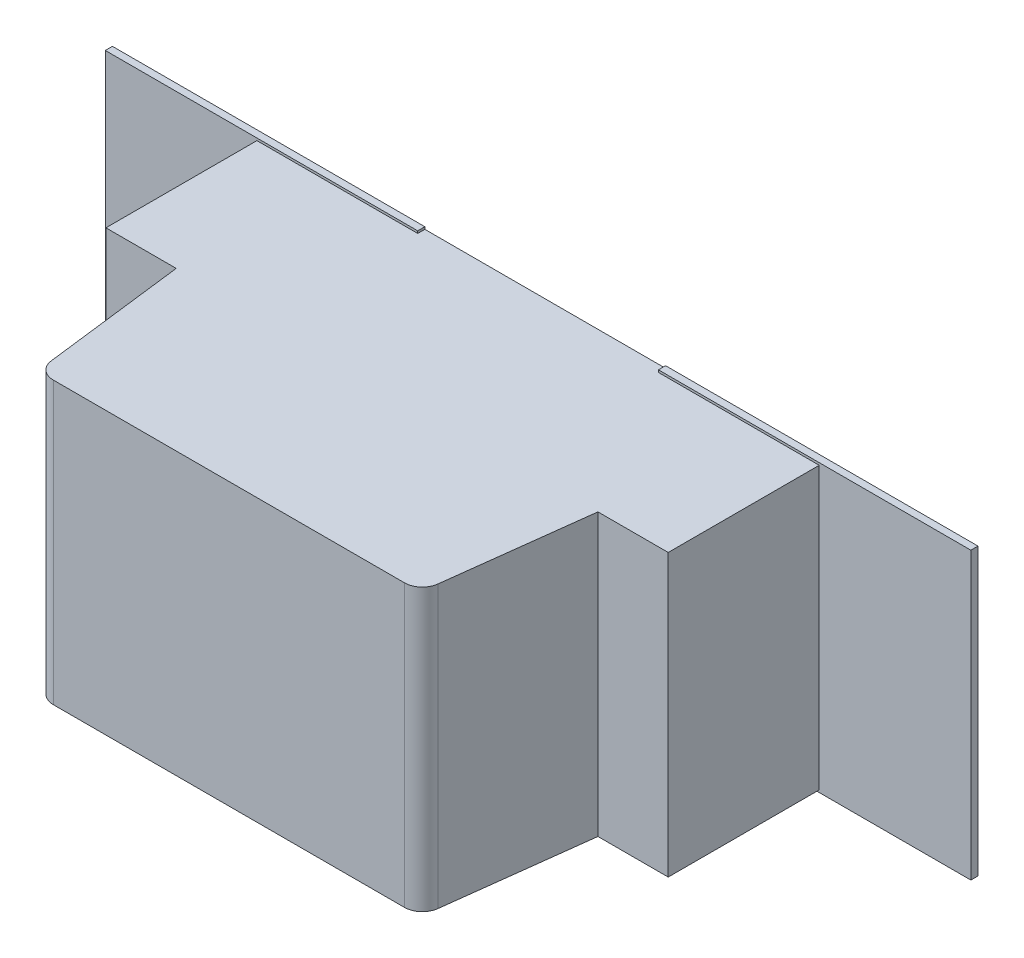
ISO-10303-21;
HEADER;
FILE_DESCRIPTION(('STEP AP214'),'2;1');
FILE_NAME('part.step','',(''),(''),'','','');
FILE_SCHEMA(('AUTOMOTIVE_DESIGN { 1 0 10303 214 1 1 1 1 }'));
ENDSEC;
DATA;
#1=APPLICATION_CONTEXT('core data for automotive mechanical design processes');
#2=APPLICATION_PROTOCOL_DEFINITION('international standard','automotive_design',2000,#1);
#3=PRODUCT_CONTEXT('',#1,'mechanical');
#4=PRODUCT('Part','Part','',(#3));
#5=PRODUCT_RELATED_PRODUCT_CATEGORY('part','',(#4));
#6=PRODUCT_DEFINITION_FORMATION('','',#4);
#7=PRODUCT_DEFINITION_CONTEXT('part definition',#1,'design');
#8=PRODUCT_DEFINITION('design','',#6,#7);
#9=PRODUCT_DEFINITION_SHAPE('','',#8);
#10=(LENGTH_UNIT() NAMED_UNIT(*) SI_UNIT(.MILLI.,.METRE.));
#11=(NAMED_UNIT(*) PLANE_ANGLE_UNIT() SI_UNIT($,.RADIAN.));
#12=(NAMED_UNIT(*) SI_UNIT($,.STERADIAN.) SOLID_ANGLE_UNIT());
#13=UNCERTAINTY_MEASURE_WITH_UNIT(LENGTH_MEASURE(1.E-05),#10,'distance_accuracy_value','');
#14=(GEOMETRIC_REPRESENTATION_CONTEXT(3) GLOBAL_UNCERTAINTY_ASSIGNED_CONTEXT((#13)) GLOBAL_UNIT_ASSIGNED_CONTEXT((#10,
#11,#12)) REPRESENTATION_CONTEXT('',''));
#15=CARTESIAN_POINT('',(0.,0.,0.));
#16=DIRECTION('',(0.,0.,1.));
#17=DIRECTION('',(1.,0.,0.));
#18=AXIS2_PLACEMENT_3D('',#15,#16,#17);
#19=CARTESIAN_POINT('',(0.,0.,0.09652));
#20=DIRECTION('',(0.,0.,1.));
#21=DIRECTION('',(1.,0.,0.));
#22=AXIS2_PLACEMENT_3D('',#19,#20,#21);
#23=PLANE('',#22);
#24=DIRECTION('',(0.,1.,0.));
#25=VECTOR('',#24,1.);
#26=CARTESIAN_POINT('',(-0.3424936,-0.4065016,0.09652));
#27=LINE('',#26,#25);
#28=CARTESIAN_POINT('',(-0.3424936,-0.4,0.09652));
#29=VERTEX_POINT('',#28);
#30=CARTESIAN_POINT('',(-0.3424936,-0.4065016,0.09652));
#31=VERTEX_POINT('',#30);
#32=EDGE_CURVE('E307',#29,#31,#27,.F.);
#33=ORIENTED_EDGE('',*,*,#32,.F.);
#34=DIRECTION('',(1.,0.,0.));
#35=VECTOR('',#34,1.);
#36=CARTESIAN_POINT('',(0.,-0.4,0.09652));
#37=LINE('',#36,#35);
#38=CARTESIAN_POINT('',(-0.8,-0.4,0.09652));
#39=VERTEX_POINT('',#38);
#40=EDGE_CURVE('E160',#29,#39,#37,.F.);
#41=ORIENTED_EDGE('',*,*,#40,.T.);
#42=DIRECTION('',(0.,1.,0.));
#43=VECTOR('',#42,1.);
#44=CARTESIAN_POINT('',(-0.8,-0.4,0.09652));
#45=LINE('',#44,#43);
#46=CARTESIAN_POINT('',(-0.8,0.4,0.09652));
#47=VERTEX_POINT('',#46);
#48=EDGE_CURVE('E228',#47,#39,#45,.F.);
#49=ORIENTED_EDGE('',*,*,#48,.F.);
#50=DIRECTION('',(1.,0.,0.));
#51=VECTOR('',#50,1.);
#52=CARTESIAN_POINT('',(0.,0.4,0.09652));
#53=LINE('',#52,#51);
#54=CARTESIAN_POINT('',(-0.3424936,0.4,0.09652));
#55=VERTEX_POINT('',#54);
#56=EDGE_CURVE('E233',#55,#47,#53,.F.);
#57=ORIENTED_EDGE('',*,*,#56,.F.);
#58=DIRECTION('',(0.,1.,0.));
#59=VECTOR('',#58,1.);
#60=CARTESIAN_POINT('',(-0.3424936,-0.4065016,0.09652));
#61=LINE('',#60,#59);
#62=CARTESIAN_POINT('',(-0.3424936,0.4065016,0.09652));
#63=VERTEX_POINT('',#62);
#64=EDGE_CURVE('E248',#63,#55,#61,.F.);
#65=ORIENTED_EDGE('',*,*,#64,.F.);
#66=DIRECTION('',(1.,0.,0.));
#67=VECTOR('',#66,1.);
#68=CARTESIAN_POINT('',(-0.3424936,0.4065016,0.09652));
#69=LINE('',#68,#67);
#70=CARTESIAN_POINT('',(-1.2314936,0.4065016,0.09652));
#71=VERTEX_POINT('',#70);
#72=EDGE_CURVE('E262',#71,#63,#69,.T.);
#73=ORIENTED_EDGE('',*,*,#72,.F.);
#74=DIRECTION('',(0.,1.,0.));
#75=VECTOR('',#74,1.);
#76=CARTESIAN_POINT('',(-1.2314936,0.4065016,0.09652));
#77=LINE('',#76,#75);
#78=CARTESIAN_POINT('',(-1.2314936,-0.4065016,0.09652));
#79=VERTEX_POINT('',#78);
#80=EDGE_CURVE('E276',#79,#71,#77,.T.);
#81=ORIENTED_EDGE('',*,*,#80,.F.);
#82=DIRECTION('',(1.,0.,0.));
#83=VECTOR('',#82,1.);
#84=CARTESIAN_POINT('',(-1.2314936,-0.4065016,0.09652));
#85=LINE('',#84,#83);
#86=EDGE_CURVE('E290',#31,#79,#85,.F.);
#87=ORIENTED_EDGE('',*,*,#86,.F.);
#88=EDGE_LOOP('',(#33,#41,#49,#57,#65,#73,#81,#87));
#89=FACE_BOUND('',#88,.T.);
#90=ADVANCED_FACE('F17',(#89),#23,.T.);
#91=CARTESIAN_POINT('',(-0.8,-0.4,0.0762));
#92=DIRECTION('',(-1.,0.,0.));
#93=DIRECTION('',(0.,0.,1.));
#94=AXIS2_PLACEMENT_3D('',#91,#92,#93);
#95=PLANE('',#94);
#96=DIRECTION('',(0.,0.,1.));
#97=VECTOR('',#96,1.);
#98=CARTESIAN_POINT('',(-0.8,0.4,0.0762));
#99=LINE('',#98,#97);
#100=CARTESIAN_POINT('',(-0.8,0.4,0.5262));
#101=VERTEX_POINT('',#100);
#102=EDGE_CURVE('E223',#47,#101,#99,.T.);
#103=ORIENTED_EDGE('',*,*,#102,.F.);
#104=ORIENTED_EDGE('',*,*,#48,.T.);
#105=DIRECTION('',(0.,0.,1.));
#106=VECTOR('',#105,1.);
#107=CARTESIAN_POINT('',(-0.8,-0.4,0.0762));
#108=LINE('',#107,#106);
#109=CARTESIAN_POINT('',(-0.8,-0.4,0.5262));
#110=VERTEX_POINT('',#109);
#111=EDGE_CURVE('E318',#39,#110,#108,.T.);
#112=ORIENTED_EDGE('',*,*,#111,.T.);
#113=DIRECTION('',(0.,1.,0.));
#114=VECTOR('',#113,1.);
#115=CARTESIAN_POINT('',(-0.8,-0.4,0.5262));
#116=LINE('',#115,#114);
#117=EDGE_CURVE('E216',#101,#110,#116,.F.);
#118=ORIENTED_EDGE('',*,*,#117,.F.);
#119=EDGE_LOOP('',(#103,#104,#112,#118));
#120=FACE_BOUND('',#119,.T.);
#121=ADVANCED_FACE('F621',(#120),#95,.T.);
#122=CARTESIAN_POINT('',(-0.8,-0.4,0.5262));
#123=DIRECTION('',(0.,0.,1.));
#124=DIRECTION('',(1.,0.,0.));
#125=AXIS2_PLACEMENT_3D('',#122,#123,#124);
#126=PLANE('',#125);
#127=ORIENTED_EDGE('',*,*,#117,.T.);
#128=DIRECTION('',(1.,0.,0.));
#129=VECTOR('',#128,1.);
#130=CARTESIAN_POINT('',(0.,-0.4,0.5262));
#131=LINE('',#130,#129);
#132=CARTESIAN_POINT('',(-0.6,-0.4,0.5262));
#133=VERTEX_POINT('',#132);
#134=EDGE_CURVE('E154',#110,#133,#131,.T.);
#135=ORIENTED_EDGE('',*,*,#134,.T.);
#136=DIRECTION('',(0.,1.,0.));
#137=VECTOR('',#136,1.);
#138=CARTESIAN_POINT('',(-0.6,-0.4,0.5262));
#139=LINE('',#138,#137);
#140=CARTESIAN_POINT('',(-0.6,0.4,0.5262));
#141=VERTEX_POINT('',#140);
#142=EDGE_CURVE('E214',#141,#133,#139,.F.);
#143=ORIENTED_EDGE('',*,*,#142,.F.);
#144=DIRECTION('',(1.,0.,0.));
#145=VECTOR('',#144,1.);
#146=CARTESIAN_POINT('',(0.,0.4,0.5262));
#147=LINE('',#146,#145);
#148=EDGE_CURVE('E219',#101,#141,#147,.T.);
#149=ORIENTED_EDGE('',*,*,#148,.F.);
#150=EDGE_LOOP('',(#127,#135,#143,#149));
#151=FACE_BOUND('',#150,.T.);
#152=ADVANCED_FACE('F613',(#151),#126,.T.);
#153=CARTESIAN_POINT('',(-0.6,-0.4,0.5262));
#154=DIRECTION('',(-0.992480588737571,0.,0.122402128164196));
#155=DIRECTION('',(0.122402128164196,0.,0.992480588737571));
#156=AXIS2_PLACEMENT_3D('',#153,#154,#155);
#157=PLANE('',#156);
#158=ORIENTED_EDGE('',*,*,#142,.T.);
#159=DIRECTION('',(0.122402128164189,0.,0.992480588737572));
#160=VECTOR('',#159,1.);
#161=CARTESIAN_POINT('',(-0.6,-0.4,0.5262));
#162=LINE('',#161,#160);
#163=CARTESIAN_POINT('',(-0.549999999999984,-0.4,0.93161802811072));
#164=VERTEX_POINT('',#163);
#165=EDGE_CURVE('E120',#133,#164,#162,.T.);
#166=ORIENTED_EDGE('',*,*,#165,.T.);
#167=DIRECTION('',(0.,1.,0.));
#168=VECTOR('',#167,1.);
#169=CARTESIAN_POINT('',(-0.549999999999974,-0.4,0.931618028110697));
#170=LINE('',#169,#168);
#171=CARTESIAN_POINT('',(-0.549999999999984,0.4,0.93161802811072));
#172=VERTEX_POINT('',#171);
#173=EDGE_CURVE('E130',#172,#164,#170,.F.);
#174=ORIENTED_EDGE('',*,*,#173,.F.);
#175=DIRECTION('',(0.122402128164189,0.,0.992480588737572));
#176=VECTOR('',#175,1.);
#177=CARTESIAN_POINT('',(-0.6,0.4,0.5262));
#178=LINE('',#177,#176);
#179=EDGE_CURVE('E222',#141,#172,#178,.T.);
#180=ORIENTED_EDGE('',*,*,#179,.F.);
#181=EDGE_LOOP('',(#158,#166,#174,#180));
#182=FACE_BOUND('',#181,.T.);
#183=ADVANCED_FACE('F605',(#182),#157,.T.);
#184=CARTESIAN_POINT('',(-0.4995819860921,-0.4,0.9254));
#185=DIRECTION('',(0.,1.,0.));
#186=DIRECTION('',(0.,0.,1.));
#187=AXIS2_PLACEMENT_3D('',#184,#185,#186);
#188=CYLINDRICAL_SURFACE('',#187,0.0508);
#189=ORIENTED_EDGE('',*,*,#173,.T.);
#190=CARTESIAN_POINT('',(-0.4995819860921,-0.4,0.9254));
#191=DIRECTION('',(0.,1.,0.));
#192=DIRECTION('',(0.,0.,1.));
#193=AXIS2_PLACEMENT_3D('',#190,#191,#192);
#194=CIRCLE('',#193,0.0508);
#195=CARTESIAN_POINT('',(-0.4995819860921,-0.4,0.9762));
#196=VERTEX_POINT('',#195);
#197=EDGE_CURVE('E20',#164,#196,#194,.T.);
#198=ORIENTED_EDGE('',*,*,#197,.T.);
#199=DIRECTION('',(0.,1.,0.));
#200=VECTOR('',#199,1.);
#201=CARTESIAN_POINT('',(-0.4995819860921,-0.4,0.9762));
#202=LINE('',#201,#200);
#203=CARTESIAN_POINT('',(-0.4995819860921,0.4,0.9762));
#204=VERTEX_POINT('',#203);
#205=EDGE_CURVE('E128',#204,#196,#202,.F.);
#206=ORIENTED_EDGE('',*,*,#205,.F.);
#207=CARTESIAN_POINT('',(-0.4995819860921,0.4,0.9254));
#208=DIRECTION('',(0.,1.,0.));
#209=DIRECTION('',(0.,0.,1.));
#210=AXIS2_PLACEMENT_3D('',#207,#208,#209);
#211=CIRCLE('',#210,0.0508);
#212=EDGE_CURVE('E339',#172,#204,#211,.T.);
#213=ORIENTED_EDGE('',*,*,#212,.F.);
#214=EDGE_LOOP('',(#189,#198,#206,#213));
#215=FACE_BOUND('',#214,.T.);
#216=ADVANCED_FACE('F126',(#215),#188,.T.);
#217=CARTESIAN_POINT('',(-0.4995819860921,-0.4,0.9762));
#218=DIRECTION('',(0.,0.,1.));
#219=DIRECTION('',(1.,0.,0.));
#220=AXIS2_PLACEMENT_3D('',#217,#218,#219);
#221=PLANE('',#220);
#222=ORIENTED_EDGE('',*,*,#205,.T.);
#223=DIRECTION('',(1.,0.,0.));
#224=VECTOR('',#223,1.);
#225=CARTESIAN_POINT('',(0.,-0.4,0.9762));
#226=LINE('',#225,#224);
#227=CARTESIAN_POINT('',(0.4995819860921,-0.4,0.9762));
#228=VERTEX_POINT('',#227);
#229=EDGE_CURVE('E133',#196,#228,#226,.T.);
#230=ORIENTED_EDGE('',*,*,#229,.T.);
#231=DIRECTION('',(0.,1.,0.));
#232=VECTOR('',#231,1.);
#233=CARTESIAN_POINT('',(0.4995819860921,-0.4,0.9762));
#234=LINE('',#233,#232);
#235=CARTESIAN_POINT('',(0.4995819860921,0.4,0.9762));
#236=VERTEX_POINT('',#235);
#237=EDGE_CURVE('E140',#236,#228,#234,.F.);
#238=ORIENTED_EDGE('',*,*,#237,.F.);
#239=DIRECTION('',(1.,0.,0.));
#240=VECTOR('',#239,1.);
#241=CARTESIAN_POINT('',(0.,0.4,0.9762));
#242=LINE('',#241,#240);
#243=EDGE_CURVE('E138',#204,#236,#242,.T.);
#244=ORIENTED_EDGE('',*,*,#243,.F.);
#245=EDGE_LOOP('',(#222,#230,#238,#244));
#246=FACE_BOUND('',#245,.T.);
#247=ADVANCED_FACE('F135',(#246),#221,.T.);
#248=CARTESIAN_POINT('',(0.4995819860921,-0.4,0.9254));
#249=DIRECTION('',(0.,1.,0.));
#250=DIRECTION('',(0.,0.,1.));
#251=AXIS2_PLACEMENT_3D('',#248,#249,#250);
#252=CYLINDRICAL_SURFACE('',#251,0.0508);
#253=ORIENTED_EDGE('',*,*,#237,.T.);
#254=CARTESIAN_POINT('',(0.4995819860921,-0.4,0.9254));
#255=DIRECTION('',(0.,1.,0.));
#256=DIRECTION('',(0.,0.,1.));
#257=AXIS2_PLACEMENT_3D('',#254,#255,#256);
#258=CIRCLE('',#257,0.0508);
#259=CARTESIAN_POINT('',(0.549999999999997,-0.4,0.931618028110722));
#260=VERTEX_POINT('',#259);
#261=EDGE_CURVE('E146',#228,#260,#258,.T.);
#262=ORIENTED_EDGE('',*,*,#261,.T.);
#263=DIRECTION('',(0.,1.,0.));
#264=VECTOR('',#263,1.);
#265=CARTESIAN_POINT('',(0.55,-0.4,0.9316180281107));
#266=LINE('',#265,#264);
#267=CARTESIAN_POINT('',(0.549999999999997,0.4,0.931618028110722));
#268=VERTEX_POINT('',#267);
#269=EDGE_CURVE('E198',#268,#260,#266,.F.);
#270=ORIENTED_EDGE('',*,*,#269,.F.);
#271=CARTESIAN_POINT('',(0.4995819860921,0.4,0.9254));
#272=DIRECTION('',(0.,1.,0.));
#273=DIRECTION('',(0.,0.,1.));
#274=AXIS2_PLACEMENT_3D('',#271,#272,#273);
#275=CIRCLE('',#274,0.0508);
#276=EDGE_CURVE('E336',#236,#268,#275,.T.);
#277=ORIENTED_EDGE('',*,*,#276,.F.);
#278=EDGE_LOOP('',(#253,#262,#270,#277));
#279=FACE_BOUND('',#278,.T.);
#280=ADVANCED_FACE('F420',(#279),#252,.T.);
#281=CARTESIAN_POINT('',(0.55,-0.4,0.9316180281107));
#282=DIRECTION('',(0.992480588737571,0.,0.122402128164196));
#283=DIRECTION('',(0.122402128164196,0.,-0.992480588737571));
#284=AXIS2_PLACEMENT_3D('',#281,#282,#283);
#285=PLANE('',#284);
#286=ORIENTED_EDGE('',*,*,#269,.T.);
#287=DIRECTION('',(0.122402128164189,0.,-0.992480588737572));
#288=VECTOR('',#287,1.);
#289=CARTESIAN_POINT('',(0.55,-0.4,0.9316180281107));
#290=LINE('',#289,#288);
#291=CARTESIAN_POINT('',(0.6,-0.4,0.5262));
#292=VERTEX_POINT('',#291);
#293=EDGE_CURVE('E148',#260,#292,#290,.T.);
#294=ORIENTED_EDGE('',*,*,#293,.T.);
#295=DIRECTION('',(0.,1.,0.));
#296=VECTOR('',#295,1.);
#297=CARTESIAN_POINT('',(0.6,-0.4,0.5262));
#298=LINE('',#297,#296);
#299=CARTESIAN_POINT('',(0.6,0.4,0.5262));
#300=VERTEX_POINT('',#299);
#301=EDGE_CURVE('E197',#300,#292,#298,.F.);
#302=ORIENTED_EDGE('',*,*,#301,.F.);
#303=DIRECTION('',(0.122402128164189,0.,-0.992480588737572));
#304=VECTOR('',#303,1.);
#305=CARTESIAN_POINT('',(0.55,0.4,0.9316180281107));
#306=LINE('',#305,#304);
#307=EDGE_CURVE('E205',#268,#300,#306,.T.);
#308=ORIENTED_EDGE('',*,*,#307,.F.);
#309=EDGE_LOOP('',(#286,#294,#302,#308));
#310=FACE_BOUND('',#309,.T.);
#311=ADVANCED_FACE('F353',(#310),#285,.T.);
#312=CARTESIAN_POINT('',(0.6,-0.4,0.5262));
#313=DIRECTION('',(0.,0.,1.));
#314=DIRECTION('',(1.,0.,0.));
#315=AXIS2_PLACEMENT_3D('',#312,#313,#314);
#316=PLANE('',#315);
#317=ORIENTED_EDGE('',*,*,#301,.T.);
#318=DIRECTION('',(1.,0.,0.));
#319=VECTOR('',#318,1.);
#320=CARTESIAN_POINT('',(0.,-0.4,0.5262));
#321=LINE('',#320,#319);
#322=CARTESIAN_POINT('',(0.8,-0.4,0.5262));
#323=VERTEX_POINT('',#322);
#324=EDGE_CURVE('E325',#292,#323,#321,.T.);
#325=ORIENTED_EDGE('',*,*,#324,.T.);
#326=DIRECTION('',(0.,1.,0.));
#327=VECTOR('',#326,1.);
#328=CARTESIAN_POINT('',(0.8,-0.4,0.5262));
#329=LINE('',#328,#327);
#330=CARTESIAN_POINT('',(0.8,0.4,0.5262));
#331=VERTEX_POINT('',#330);
#332=EDGE_CURVE('E194',#331,#323,#329,.F.);
#333=ORIENTED_EDGE('',*,*,#332,.F.);
#334=DIRECTION('',(1.,0.,0.));
#335=VECTOR('',#334,1.);
#336=CARTESIAN_POINT('',(0.,0.4,0.5262));
#337=LINE('',#336,#335);
#338=EDGE_CURVE('E201',#300,#331,#337,.T.);
#339=ORIENTED_EDGE('',*,*,#338,.F.);
#340=EDGE_LOOP('',(#317,#325,#333,#339));
#341=FACE_BOUND('',#340,.T.);
#342=ADVANCED_FACE('F357',(#341),#316,.T.);
#343=CARTESIAN_POINT('',(0.8,-0.4,0.5262));
#344=DIRECTION('',(1.,0.,0.));
#345=DIRECTION('',(0.,0.,-1.));
#346=AXIS2_PLACEMENT_3D('',#343,#344,#345);
#347=PLANE('',#346);
#348=DIRECTION('',(0.,0.,1.));
#349=VECTOR('',#348,1.);
#350=CARTESIAN_POINT('',(0.8,-0.4,0.0762));
#351=LINE('',#350,#349);
#352=CARTESIAN_POINT('',(0.8,-0.4,0.09652));
#353=VERTEX_POINT('',#352);
#354=EDGE_CURVE('E309',#323,#353,#351,.F.);
#355=ORIENTED_EDGE('',*,*,#354,.T.);
#356=DIRECTION('',(0.,1.,0.));
#357=VECTOR('',#356,1.);
#358=CARTESIAN_POINT('',(0.8,0.,0.09652));
#359=LINE('',#358,#357);
#360=CARTESIAN_POINT('',(0.8,0.4,0.09652));
#361=VERTEX_POINT('',#360);
#362=EDGE_CURVE('E191',#361,#353,#359,.F.);
#363=ORIENTED_EDGE('',*,*,#362,.F.);
#364=DIRECTION('',(0.,0.,1.));
#365=VECTOR('',#364,1.);
#366=CARTESIAN_POINT('',(0.8,0.4,0.0762));
#367=LINE('',#366,#365);
#368=EDGE_CURVE('E204',#331,#361,#367,.F.);
#369=ORIENTED_EDGE('',*,*,#368,.F.);
#370=ORIENTED_EDGE('',*,*,#332,.T.);
#371=EDGE_LOOP('',(#355,#363,#369,#370));
#372=FACE_BOUND('',#371,.T.);
#373=ADVANCED_FACE('F367',(#372),#347,.T.);
#374=CARTESIAN_POINT('',(0.,0.,0.09652));
#375=DIRECTION('',(0.,0.,1.));
#376=DIRECTION('',(1.,0.,0.));
#377=AXIS2_PLACEMENT_3D('',#374,#375,#376);
#378=PLANE('',#377);
#379=ORIENTED_EDGE('',*,*,#362,.T.);
#380=DIRECTION('',(1.,0.,0.));
#381=VECTOR('',#380,1.);
#382=CARTESIAN_POINT('',(0.,-0.4,0.09652));
#383=LINE('',#382,#381);
#384=CARTESIAN_POINT('',(0.3424936,-0.4,0.09652));
#385=VERTEX_POINT('',#384);
#386=EDGE_CURVE('E161',#353,#385,#383,.F.);
#387=ORIENTED_EDGE('',*,*,#386,.T.);
#388=DIRECTION('',(0.,1.,0.));
#389=VECTOR('',#388,1.);
#390=CARTESIAN_POINT('',(0.3424936,0.4065016,0.09652));
#391=LINE('',#390,#389);
#392=CARTESIAN_POINT('',(0.3424936,-0.4065016,0.09652));
#393=VERTEX_POINT('',#392);
#394=EDGE_CURVE('E164',#393,#385,#391,.T.);
#395=ORIENTED_EDGE('',*,*,#394,.F.);
#396=DIRECTION('',(1.,0.,0.));
#397=VECTOR('',#396,1.);
#398=CARTESIAN_POINT('',(0.3424936,-0.4065016,0.09652));
#399=LINE('',#398,#397);
#400=CARTESIAN_POINT('',(1.2314936,-0.4065016,0.09652));
#401=VERTEX_POINT('',#400);
#402=EDGE_CURVE('E170',#401,#393,#399,.F.);
#403=ORIENTED_EDGE('',*,*,#402,.F.);
#404=DIRECTION('',(0.,1.,0.));
#405=VECTOR('',#404,1.);
#406=CARTESIAN_POINT('',(1.2314936,-0.4065016,0.09652));
#407=LINE('',#406,#405);
#408=CARTESIAN_POINT('',(1.2314936,0.4065016,0.09652));
#409=VERTEX_POINT('',#408);
#410=EDGE_CURVE('E176',#409,#401,#407,.F.);
#411=ORIENTED_EDGE('',*,*,#410,.F.);
#412=DIRECTION('',(1.,0.,0.));
#413=VECTOR('',#412,1.);
#414=CARTESIAN_POINT('',(1.2314936,0.4065016,0.09652));
#415=LINE('',#414,#413);
#416=CARTESIAN_POINT('',(0.3424936,0.4065016,0.09652));
#417=VERTEX_POINT('',#416);
#418=EDGE_CURVE('E182',#417,#409,#415,.T.);
#419=ORIENTED_EDGE('',*,*,#418,.F.);
#420=DIRECTION('',(0.,1.,0.));
#421=VECTOR('',#420,1.);
#422=CARTESIAN_POINT('',(0.3424936,0.4065016,0.09652));
#423=LINE('',#422,#421);
#424=CARTESIAN_POINT('',(0.3424936,0.4,0.09652));
#425=VERTEX_POINT('',#424);
#426=EDGE_CURVE('E188',#425,#417,#423,.T.);
#427=ORIENTED_EDGE('',*,*,#426,.F.);
#428=DIRECTION('',(1.,0.,0.));
#429=VECTOR('',#428,1.);
#430=CARTESIAN_POINT('',(0.,0.4,0.09652));
#431=LINE('',#430,#429);
#432=EDGE_CURVE('E409',#361,#425,#431,.F.);
#433=ORIENTED_EDGE('',*,*,#432,.F.);
#434=EDGE_LOOP('',(#379,#387,#395,#403,#411,#419,#427,#433));
#435=FACE_BOUND('',#434,.T.);
#436=ADVANCED_FACE('F393',(#435),#378,.T.);
#437=CARTESIAN_POINT('',(0.3424936,0.4065016,0.0762));
#438=DIRECTION('',(-1.,0.,0.));
#439=DIRECTION('',(0.,0.,1.));
#440=AXIS2_PLACEMENT_3D('',#437,#438,#439);
#441=PLANE('',#440);
#442=DIRECTION('',(0.,1.,0.));
#443=VECTOR('',#442,1.);
#444=CARTESIAN_POINT('',(0.3424936,-0.4,0.0762));
#445=LINE('',#444,#443);
#446=CARTESIAN_POINT('',(0.3424936,0.4,0.0762));
#447=VERTEX_POINT('',#446);
#448=CARTESIAN_POINT('',(0.3424936,0.4065016,0.0762));
#449=VERTEX_POINT('',#448);
#450=EDGE_CURVE('E406',#447,#449,#445,.T.);
#451=ORIENTED_EDGE('',*,*,#450,.F.);
#452=DIRECTION('',(0.,0.,1.));
#453=VECTOR('',#452,1.);
#454=CARTESIAN_POINT('',(0.3424936,0.4,0.0762));
#455=LINE('',#454,#453);
#456=EDGE_CURVE('E245',#425,#447,#455,.F.);
#457=ORIENTED_EDGE('',*,*,#456,.F.);
#458=ORIENTED_EDGE('',*,*,#426,.T.);
#459=DIRECTION('',(0.,0.,1.));
#460=VECTOR('',#459,1.);
#461=CARTESIAN_POINT('',(0.3424936,0.4065016,0.0762));
#462=LINE('',#461,#460);
#463=EDGE_CURVE('E185',#449,#417,#462,.T.);
#464=ORIENTED_EDGE('',*,*,#463,.F.);
#465=EDGE_LOOP('',(#451,#457,#458,#464));
#466=FACE_BOUND('',#465,.T.);
#467=ADVANCED_FACE('F389',(#466),#441,.T.);
#468=CARTESIAN_POINT('',(1.2314936,0.4065016,0.0762));
#469=DIRECTION('',(0.,1.,0.));
#470=DIRECTION('',(0.,0.,1.));
#471=AXIS2_PLACEMENT_3D('',#468,#469,#470);
#472=PLANE('',#471);
#473=DIRECTION('',(0.,0.,-1.));
#474=VECTOR('',#473,1.);
#475=CARTESIAN_POINT('',(1.2314936,0.4065016,0.0762));
#476=LINE('',#475,#474);
#477=CARTESIAN_POINT('',(1.2314936,0.4065016,0.0762));
#478=VERTEX_POINT('',#477);
#479=EDGE_CURVE('E179',#478,#409,#476,.F.);
#480=ORIENTED_EDGE('',*,*,#479,.F.);
#481=DIRECTION('',(-1.,0.,0.));
#482=VECTOR('',#481,1.);
#483=CARTESIAN_POINT('',(0.8,0.4065016,0.0762));
#484=LINE('',#483,#482);
#485=EDGE_CURVE('E397',#449,#478,#484,.F.);
#486=ORIENTED_EDGE('',*,*,#485,.F.);
#487=ORIENTED_EDGE('',*,*,#463,.T.);
#488=ORIENTED_EDGE('',*,*,#418,.T.);
#489=EDGE_LOOP('',(#480,#486,#487,#488));
#490=FACE_BOUND('',#489,.T.);
#491=ADVANCED_FACE('F395',(#490),#472,.T.);
#492=CARTESIAN_POINT('',(1.2314936,-0.4065016,0.0762));
#493=DIRECTION('',(1.,0.,0.));
#494=DIRECTION('',(0.,0.,-1.));
#495=AXIS2_PLACEMENT_3D('',#492,#493,#494);
#496=PLANE('',#495);
#497=DIRECTION('',(0.,0.,-1.));
#498=VECTOR('',#497,1.);
#499=CARTESIAN_POINT('',(1.2314936,-0.4065016,0.0762));
#500=LINE('',#499,#498);
#501=CARTESIAN_POINT('',(1.2314936,-0.4065016,0.0762));
#502=VERTEX_POINT('',#501);
#503=EDGE_CURVE('E173',#502,#401,#500,.F.);
#504=ORIENTED_EDGE('',*,*,#503,.F.);
#505=DIRECTION('',(0.,1.,0.));
#506=VECTOR('',#505,1.);
#507=CARTESIAN_POINT('',(1.2314936,-0.4,0.0762));
#508=LINE('',#507,#506);
#509=EDGE_CURVE('E405',#478,#502,#508,.F.);
#510=ORIENTED_EDGE('',*,*,#509,.F.);
#511=ORIENTED_EDGE('',*,*,#479,.T.);
#512=ORIENTED_EDGE('',*,*,#410,.T.);
#513=EDGE_LOOP('',(#504,#510,#511,#512));
#514=FACE_BOUND('',#513,.T.);
#515=ADVANCED_FACE('F465',(#514),#496,.T.);
#516=CARTESIAN_POINT('',(0.3424936,-0.4065016,0.0762));
#517=DIRECTION('',(0.,-1.,0.));
#518=DIRECTION('',(0.,0.,-1.));
#519=AXIS2_PLACEMENT_3D('',#516,#517,#518);
#520=PLANE('',#519);
#521=DIRECTION('',(0.,0.,1.));
#522=VECTOR('',#521,1.);
#523=CARTESIAN_POINT('',(0.3424936,-0.4065016,0.0762));
#524=LINE('',#523,#522);
#525=CARTESIAN_POINT('',(0.3424936,-0.4065016,0.0762));
#526=VERTEX_POINT('',#525);
#527=EDGE_CURVE('E167',#526,#393,#524,.T.);
#528=ORIENTED_EDGE('',*,*,#527,.F.);
#529=DIRECTION('',(-1.,0.,0.));
#530=VECTOR('',#529,1.);
#531=CARTESIAN_POINT('',(0.8,-0.4065016,0.0762));
#532=LINE('',#531,#530);
#533=EDGE_CURVE('E688',#502,#526,#532,.T.);
#534=ORIENTED_EDGE('',*,*,#533,.F.);
#535=ORIENTED_EDGE('',*,*,#503,.T.);
#536=ORIENTED_EDGE('',*,*,#402,.T.);
#537=EDGE_LOOP('',(#528,#534,#535,#536));
#538=FACE_BOUND('',#537,.T.);
#539=ADVANCED_FACE('F461',(#538),#520,.T.);
#540=CARTESIAN_POINT('',(0.3424936,0.4065016,0.0762));
#541=DIRECTION('',(-1.,0.,0.));
#542=DIRECTION('',(0.,0.,1.));
#543=AXIS2_PLACEMENT_3D('',#540,#541,#542);
#544=PLANE('',#543);
#545=ORIENTED_EDGE('',*,*,#394,.T.);
#546=DIRECTION('',(0.,0.,1.));
#547=VECTOR('',#546,1.);
#548=CARTESIAN_POINT('',(0.3424936,-0.4,0.0762));
#549=LINE('',#548,#547);
#550=CARTESIAN_POINT('',(0.3424936,-0.4,0.0762));
#551=VERTEX_POINT('',#550);
#552=EDGE_CURVE('E157',#385,#551,#549,.F.);
#553=ORIENTED_EDGE('',*,*,#552,.T.);
#554=DIRECTION('',(0.,1.,0.));
#555=VECTOR('',#554,1.);
#556=CARTESIAN_POINT('',(0.3424936,-0.4,0.0762));
#557=LINE('',#556,#555);
#558=EDGE_CURVE('E686',#526,#551,#557,.T.);
#559=ORIENTED_EDGE('',*,*,#558,.F.);
#560=ORIENTED_EDGE('',*,*,#527,.T.);
#561=EDGE_LOOP('',(#545,#553,#559,#560));
#562=FACE_BOUND('',#561,.T.);
#563=ADVANCED_FACE('F458',(#562),#544,.T.);
#564=CARTESIAN_POINT('',(0.,-0.4,0.0762));
#565=DIRECTION('',(0.,1.,0.));
#566=DIRECTION('',(0.,0.,1.));
#567=AXIS2_PLACEMENT_3D('',#564,#565,#566);
#568=PLANE('',#567);
#569=ORIENTED_EDGE('',*,*,#324,.F.);
#570=ORIENTED_EDGE('',*,*,#293,.F.);
#571=ORIENTED_EDGE('',*,*,#261,.F.);
#572=ORIENTED_EDGE('',*,*,#229,.F.);
#573=ORIENTED_EDGE('',*,*,#197,.F.);
#574=ORIENTED_EDGE('',*,*,#165,.F.);
#575=ORIENTED_EDGE('',*,*,#134,.F.);
#576=ORIENTED_EDGE('',*,*,#111,.F.);
#577=ORIENTED_EDGE('',*,*,#40,.F.);
#578=DIRECTION('',(0.,0.,-1.));
#579=VECTOR('',#578,1.);
#580=CARTESIAN_POINT('',(-0.3424936,-0.4,0.0762));
#581=LINE('',#580,#579);
#582=CARTESIAN_POINT('',(-0.3424936,-0.4,0.0762));
#583=VERTEX_POINT('',#582);
#584=EDGE_CURVE('E304',#583,#29,#581,.F.);
#585=ORIENTED_EDGE('',*,*,#584,.F.);
#586=DIRECTION('',(-1.,0.,0.));
#587=VECTOR('',#586,1.);
#588=CARTESIAN_POINT('',(0.8,-0.4,0.0762));
#589=LINE('',#588,#587);
#590=EDGE_CURVE('E314',#551,#583,#589,.T.);
#591=ORIENTED_EDGE('',*,*,#590,.F.);
#592=ORIENTED_EDGE('',*,*,#552,.F.);
#593=ORIENTED_EDGE('',*,*,#386,.F.);
#594=ORIENTED_EDGE('',*,*,#354,.F.);
#595=EDGE_LOOP('',(#569,#570,#571,#572,#573,#574,#575,#576,#577,#585,#591,#592,#593,#594));
#596=FACE_BOUND('',#595,.T.);
#597=ADVANCED_FACE('F144',(#596),#568,.F.);
#598=CARTESIAN_POINT('',(-0.3424936,-0.4065016,0.0762));
#599=DIRECTION('',(1.,0.,0.));
#600=DIRECTION('',(0.,0.,-1.));
#601=AXIS2_PLACEMENT_3D('',#598,#599,#600);
#602=PLANE('',#601);
#603=DIRECTION('',(0.,1.,0.));
#604=VECTOR('',#603,1.);
#605=CARTESIAN_POINT('',(-0.3424936,-0.4,0.0762));
#606=LINE('',#605,#604);
#607=CARTESIAN_POINT('',(-0.3424936,-0.4065016,0.0762));
#608=VERTEX_POINT('',#607);
#609=EDGE_CURVE('E299',#583,#608,#606,.F.);
#610=ORIENTED_EDGE('',*,*,#609,.F.);
#611=ORIENTED_EDGE('',*,*,#584,.T.);
#612=ORIENTED_EDGE('',*,*,#32,.T.);
#613=DIRECTION('',(0.,0.,-1.));
#614=VECTOR('',#613,1.);
#615=CARTESIAN_POINT('',(-0.3424936,-0.4065016,0.0762));
#616=LINE('',#615,#614);
#617=EDGE_CURVE('E294',#608,#31,#616,.F.);
#618=ORIENTED_EDGE('',*,*,#617,.F.);
#619=EDGE_LOOP('',(#610,#611,#612,#618));
#620=FACE_BOUND('',#619,.T.);
#621=ADVANCED_FACE('F451',(#620),#602,.T.);
#622=CARTESIAN_POINT('',(-1.2314936,-0.4065016,0.0762));
#623=DIRECTION('',(0.,-1.,0.));
#624=DIRECTION('',(0.,0.,-1.));
#625=AXIS2_PLACEMENT_3D('',#622,#623,#624);
#626=PLANE('',#625);
#627=DIRECTION('',(0.,0.,1.));
#628=VECTOR('',#627,1.);
#629=CARTESIAN_POINT('',(-1.2314936,-0.4065016,0.0762));
#630=LINE('',#629,#628);
#631=CARTESIAN_POINT('',(-1.2314936,-0.4065016,0.0762));
#632=VERTEX_POINT('',#631);
#633=EDGE_CURVE('E280',#632,#79,#630,.T.);
#634=ORIENTED_EDGE('',*,*,#633,.F.);
#635=DIRECTION('',(-1.,0.,0.));
#636=VECTOR('',#635,1.);
#637=CARTESIAN_POINT('',(0.8,-0.4065016,0.0762));
#638=LINE('',#637,#636);
#639=EDGE_CURVE('E285',#608,#632,#638,.T.);
#640=ORIENTED_EDGE('',*,*,#639,.F.);
#641=ORIENTED_EDGE('',*,*,#617,.T.);
#642=ORIENTED_EDGE('',*,*,#86,.T.);
#643=EDGE_LOOP('',(#634,#640,#641,#642));
#644=FACE_BOUND('',#643,.T.);
#645=ADVANCED_FACE('F447',(#644),#626,.T.);
#646=CARTESIAN_POINT('',(-1.2314936,0.4065016,0.0762));
#647=DIRECTION('',(-1.,0.,0.));
#648=DIRECTION('',(0.,0.,1.));
#649=AXIS2_PLACEMENT_3D('',#646,#647,#648);
#650=PLANE('',#649);
#651=DIRECTION('',(0.,0.,1.));
#652=VECTOR('',#651,1.);
#653=CARTESIAN_POINT('',(-1.2314936,0.4065016,0.0762));
#654=LINE('',#653,#652);
#655=CARTESIAN_POINT('',(-1.2314936,0.4065016,0.0762));
#656=VERTEX_POINT('',#655);
#657=EDGE_CURVE('E266',#656,#71,#654,.T.);
#658=ORIENTED_EDGE('',*,*,#657,.F.);
#659=DIRECTION('',(0.,1.,0.));
#660=VECTOR('',#659,1.);
#661=CARTESIAN_POINT('',(-1.2314936,-0.4,0.0762));
#662=LINE('',#661,#660);
#663=EDGE_CURVE('E271',#632,#656,#662,.T.);
#664=ORIENTED_EDGE('',*,*,#663,.F.);
#665=ORIENTED_EDGE('',*,*,#633,.T.);
#666=ORIENTED_EDGE('',*,*,#80,.T.);
#667=EDGE_LOOP('',(#658,#664,#665,#666));
#668=FACE_BOUND('',#667,.T.);
#669=ADVANCED_FACE('F443',(#668),#650,.T.);
#670=CARTESIAN_POINT('',(-0.3424936,0.4065016,0.0762));
#671=DIRECTION('',(0.,1.,0.));
#672=DIRECTION('',(0.,0.,1.));
#673=AXIS2_PLACEMENT_3D('',#670,#671,#672);
#674=PLANE('',#673);
#675=DIRECTION('',(0.,0.,-1.));
#676=VECTOR('',#675,1.);
#677=CARTESIAN_POINT('',(-0.3424936,0.4065016,0.0762));
#678=LINE('',#677,#676);
#679=CARTESIAN_POINT('',(-0.3424936,0.4065016,0.0762));
#680=VERTEX_POINT('',#679);
#681=EDGE_CURVE('E250',#680,#63,#678,.F.);
#682=ORIENTED_EDGE('',*,*,#681,.F.);
#683=DIRECTION('',(-1.,0.,0.));
#684=VECTOR('',#683,1.);
#685=CARTESIAN_POINT('',(0.8,0.4065016,0.0762));
#686=LINE('',#685,#684);
#687=EDGE_CURVE('E257',#656,#680,#686,.F.);
#688=ORIENTED_EDGE('',*,*,#687,.F.);
#689=ORIENTED_EDGE('',*,*,#657,.T.);
#690=ORIENTED_EDGE('',*,*,#72,.T.);
#691=EDGE_LOOP('',(#682,#688,#689,#690));
#692=FACE_BOUND('',#691,.T.);
#693=ADVANCED_FACE('F440',(#692),#674,.T.);
#694=CARTESIAN_POINT('',(-0.3424936,-0.4065016,0.0762));
#695=DIRECTION('',(1.,0.,0.));
#696=DIRECTION('',(0.,0.,-1.));
#697=AXIS2_PLACEMENT_3D('',#694,#695,#696);
#698=PLANE('',#697);
#699=ORIENTED_EDGE('',*,*,#64,.T.);
#700=DIRECTION('',(0.,0.,1.));
#701=VECTOR('',#700,1.);
#702=CARTESIAN_POINT('',(-0.3424936,0.4,0.0762));
#703=LINE('',#702,#701);
#704=CARTESIAN_POINT('',(-0.3424936,0.4,0.0762));
#705=VERTEX_POINT('',#704);
#706=EDGE_CURVE('E35',#705,#55,#703,.T.);
#707=ORIENTED_EDGE('',*,*,#706,.F.);
#708=DIRECTION('',(0.,1.,0.));
#709=VECTOR('',#708,1.);
#710=CARTESIAN_POINT('',(-0.3424936,-0.4,0.0762));
#711=LINE('',#710,#709);
#712=EDGE_CURVE('E26',#680,#705,#711,.F.);
#713=ORIENTED_EDGE('',*,*,#712,.F.);
#714=ORIENTED_EDGE('',*,*,#681,.T.);
#715=EDGE_LOOP('',(#699,#707,#713,#714));
#716=FACE_BOUND('',#715,.T.);
#717=ADVANCED_FACE('F435',(#716),#698,.T.);
#718=CARTESIAN_POINT('',(0.,0.4,0.0762));
#719=DIRECTION('',(0.,1.,0.));
#720=DIRECTION('',(0.,0.,1.));
#721=AXIS2_PLACEMENT_3D('',#718,#719,#720);
#722=PLANE('',#721);
#723=ORIENTED_EDGE('',*,*,#368,.T.);
#724=ORIENTED_EDGE('',*,*,#432,.T.);
#725=ORIENTED_EDGE('',*,*,#456,.T.);
#726=DIRECTION('',(-1.,0.,0.));
#727=VECTOR('',#726,1.);
#728=CARTESIAN_POINT('',(0.8,0.4,0.0762));
#729=LINE('',#728,#727);
#730=EDGE_CURVE('E11',#705,#447,#729,.F.);
#731=ORIENTED_EDGE('',*,*,#730,.F.);
#732=ORIENTED_EDGE('',*,*,#706,.T.);
#733=ORIENTED_EDGE('',*,*,#56,.T.);
#734=ORIENTED_EDGE('',*,*,#102,.T.);
#735=ORIENTED_EDGE('',*,*,#148,.T.);
#736=ORIENTED_EDGE('',*,*,#179,.T.);
#737=ORIENTED_EDGE('',*,*,#212,.T.);
#738=ORIENTED_EDGE('',*,*,#243,.T.);
#739=ORIENTED_EDGE('',*,*,#276,.T.);
#740=ORIENTED_EDGE('',*,*,#307,.T.);
#741=ORIENTED_EDGE('',*,*,#338,.T.);
#742=EDGE_LOOP('',(#723,#724,#725,#731,#732,#733,#734,#735,#736,#737,#738,#739,#740,#741));
#743=FACE_BOUND('',#742,.T.);
#744=ADVANCED_FACE('F417',(#743),#722,.T.);
#745=CARTESIAN_POINT('',(0.8,-0.4,0.0762));
#746=DIRECTION('',(0.,0.,-1.));
#747=DIRECTION('',(-1.,0.,0.));
#748=AXIS2_PLACEMENT_3D('',#745,#746,#747);
#749=PLANE('',#748);
#750=ORIENTED_EDGE('',*,*,#712,.T.);
#751=ORIENTED_EDGE('',*,*,#730,.T.);
#752=ORIENTED_EDGE('',*,*,#450,.T.);
#753=ORIENTED_EDGE('',*,*,#485,.T.);
#754=ORIENTED_EDGE('',*,*,#509,.T.);
#755=ORIENTED_EDGE('',*,*,#533,.T.);
#756=ORIENTED_EDGE('',*,*,#558,.T.);
#757=ORIENTED_EDGE('',*,*,#590,.T.);
#758=ORIENTED_EDGE('',*,*,#609,.T.);
#759=ORIENTED_EDGE('',*,*,#639,.T.);
#760=ORIENTED_EDGE('',*,*,#663,.T.);
#761=ORIENTED_EDGE('',*,*,#687,.T.);
#762=EDGE_LOOP('',(#750,#751,#752,#753,#754,#755,#756,#757,#758,#759,#760,#761));
#763=FACE_BOUND('',#762,.T.);
#764=ADVANCED_FACE('F408',(#763),#749,.T.);
#765=CLOSED_SHELL('',(#90,#121,#152,#183,#216,#247,#280,#311,#342,#373,#436,#467,#491,#515,#539,
#563,#597,#621,#645,#669,#693,#717,#744,#764));
#766=MANIFOLD_SOLID_BREP('B1',#765);
#767=ADVANCED_BREP_SHAPE_REPRESENTATION('',(#18,#766),#14);
#768=SHAPE_DEFINITION_REPRESENTATION(#9,#767);
ENDSEC;
END-ISO-10303-21;
